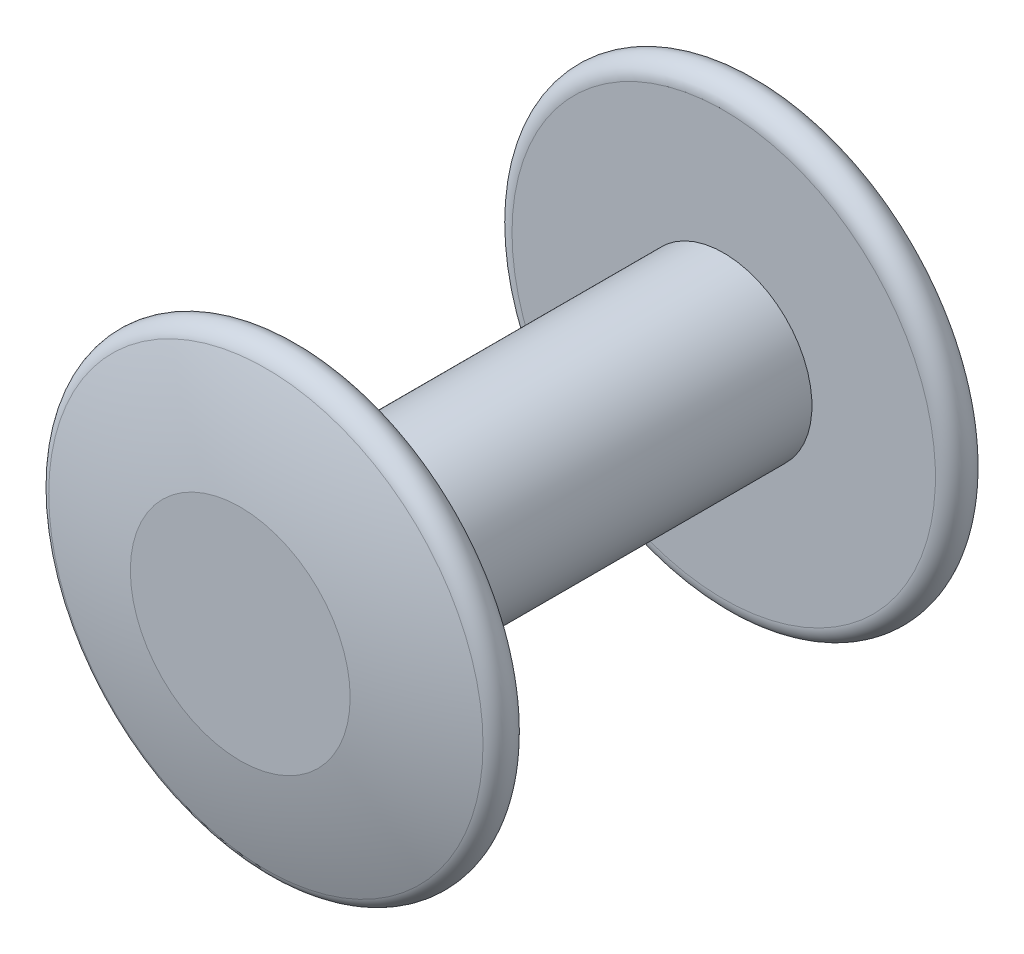
ISO-10303-21;
HEADER;
FILE_DESCRIPTION(('STEP AP214'),'2;1');
FILE_NAME('part.step','',(''),(''),'','','');
FILE_SCHEMA(('AUTOMOTIVE_DESIGN { 1 0 10303 214 1 1 1 1 }'));
ENDSEC;
DATA;
#1=APPLICATION_CONTEXT('core data for automotive mechanical design processes');
#2=APPLICATION_PROTOCOL_DEFINITION('international standard','automotive_design',2000,#1);
#3=PRODUCT_CONTEXT('',#1,'mechanical');
#4=PRODUCT('Part','Part','',(#3));
#5=PRODUCT_RELATED_PRODUCT_CATEGORY('part','',(#4));
#6=PRODUCT_DEFINITION_FORMATION('','',#4);
#7=PRODUCT_DEFINITION_CONTEXT('part definition',#1,'design');
#8=PRODUCT_DEFINITION('design','',#6,#7);
#9=PRODUCT_DEFINITION_SHAPE('','',#8);
#10=(LENGTH_UNIT() NAMED_UNIT(*) SI_UNIT(.MILLI.,.METRE.));
#11=(NAMED_UNIT(*) PLANE_ANGLE_UNIT() SI_UNIT($,.RADIAN.));
#12=(NAMED_UNIT(*) SI_UNIT($,.STERADIAN.) SOLID_ANGLE_UNIT());
#13=UNCERTAINTY_MEASURE_WITH_UNIT(LENGTH_MEASURE(1.E-05),#10,'distance_accuracy_value','');
#14=(GEOMETRIC_REPRESENTATION_CONTEXT(3) GLOBAL_UNCERTAINTY_ASSIGNED_CONTEXT((#13)) GLOBAL_UNIT_ASSIGNED_CONTEXT((#10,
#11,#12)) REPRESENTATION_CONTEXT('',''));
#15=CARTESIAN_POINT('',(0.,0.,0.));
#16=DIRECTION('',(0.,0.,1.));
#17=DIRECTION('',(1.,0.,0.));
#18=AXIS2_PLACEMENT_3D('',#15,#16,#17);
#19=CARTESIAN_POINT('',(0.,0.,6.5));
#20=DIRECTION('',(0.,0.,-1.));
#21=DIRECTION('',(-1.,0.,0.));
#22=AXIS2_PLACEMENT_3D('',#19,#20,#21);
#23=TOROIDAL_SURFACE('',#22,6.,0.5);
#24=CARTESIAN_POINT('',(0.,0.,6.));
#25=DIRECTION('',(0.,0.,-1.));
#26=DIRECTION('',(-1.,0.,0.));
#27=AXIS2_PLACEMENT_3D('',#24,#25,#26);
#28=CIRCLE('',#27,6.);
#29=CARTESIAN_POINT('',(-6.,0.,6.));
#30=VERTEX_POINT('',#29);
#31=EDGE_CURVE('E40',#30,#30,#28,.T.);
#32=ORIENTED_EDGE('',*,*,#31,.F.);
#33=EDGE_LOOP('',(#32));
#34=FACE_BOUND('',#33,.T.);
#35=CARTESIAN_POINT('',(0.,0.,6.97574295680204));
#36=DIRECTION('',(0.,0.,-1.));
#37=DIRECTION('',(-1.,0.,0.));
#38=AXIS2_PLACEMENT_3D('',#35,#36,#37);
#39=CIRCLE('',#38,6.15384615384616);
#40=CARTESIAN_POINT('',(-6.15384615384616,0.,6.97574295680204));
#41=VERTEX_POINT('',#40);
#42=EDGE_CURVE('E8',#41,#41,#39,.T.);
#43=ORIENTED_EDGE('',*,*,#42,.T.);
#44=EDGE_LOOP('',(#43));
#45=FACE_BOUND('',#44,.T.);
#46=ADVANCED_FACE('F12',(#34,#45),#23,.T.);
#47=CARTESIAN_POINT('',(0.,0.,-12.0539753152795));
#48=DIRECTION('',(0.,0.,-1.));
#49=DIRECTION('',(0.,1.,0.));
#50=AXIS2_PLACEMENT_3D('',#47,#48,#49);
#51=SPHERICAL_SURFACE('',#50,20.);
#52=ORIENTED_EDGE('',*,*,#42,.F.);
#53=EDGE_LOOP('',(#52));
#54=FACE_BOUND('',#53,.T.);
#55=CARTESIAN_POINT('',(0.,0.,7.70196512603628));
#56=DIRECTION('',(0.,0.,-1.));
#57=DIRECTION('',(-1.,0.,0.));
#58=AXIS2_PLACEMENT_3D('',#55,#56,#57);
#59=CIRCLE('',#58,3.11493455455888);
#60=CARTESIAN_POINT('',(-3.11493455455888,0.,7.70196512603628));
#61=VERTEX_POINT('',#60);
#62=EDGE_CURVE('E18',#61,#61,#59,.T.);
#63=ORIENTED_EDGE('',*,*,#62,.T.);
#64=EDGE_LOOP('',(#63));
#65=FACE_BOUND('',#64,.T.);
#66=ADVANCED_FACE('F47',(#54,#65),#51,.T.);
#67=CARTESIAN_POINT('',(0.,0.,7.70196512603628));
#68=DIRECTION('',(0.,0.,1.));
#69=DIRECTION('',(1.,0.,0.));
#70=AXIS2_PLACEMENT_3D('',#67,#68,#69);
#71=PLANE('',#70);
#72=ORIENTED_EDGE('',*,*,#62,.F.);
#73=EDGE_LOOP('',(#72));
#74=FACE_BOUND('',#73,.T.);
#75=ADVANCED_FACE('F53',(#74),#71,.T.);
#76=CARTESIAN_POINT('',(0.,0.,-7.70196512603628));
#77=DIRECTION('',(0.,0.,-1.));
#78=DIRECTION('',(-1.,0.,0.));
#79=AXIS2_PLACEMENT_3D('',#76,#77,#78);
#80=PLANE('',#79);
#81=CARTESIAN_POINT('',(0.,0.,-7.70196512603628));
#82=DIRECTION('',(0.,0.,-1.));
#83=DIRECTION('',(-1.,0.,0.));
#84=AXIS2_PLACEMENT_3D('',#81,#82,#83);
#85=CIRCLE('',#84,3.11493455455888);
#86=CARTESIAN_POINT('',(-3.11493455455888,0.,-7.70196512603628));
#87=VERTEX_POINT('',#86);
#88=EDGE_CURVE('E22',#87,#87,#85,.T.);
#89=ORIENTED_EDGE('',*,*,#88,.T.);
#90=EDGE_LOOP('',(#89));
#91=FACE_BOUND('',#90,.T.);
#92=ADVANCED_FACE('F59',(#91),#80,.T.);
#93=CARTESIAN_POINT('',(0.,0.,12.0539753152795));
#94=DIRECTION('',(0.,0.,-1.));
#95=DIRECTION('',(0.,1.,0.));
#96=AXIS2_PLACEMENT_3D('',#93,#94,#95);
#97=SPHERICAL_SURFACE('',#96,20.);
#98=CARTESIAN_POINT('',(0.,0.,-6.97574295680204));
#99=DIRECTION('',(0.,0.,-1.));
#100=DIRECTION('',(-1.,0.,0.));
#101=AXIS2_PLACEMENT_3D('',#98,#99,#100);
#102=CIRCLE('',#101,6.15384615384616);
#103=CARTESIAN_POINT('',(-6.15384615384616,0.,-6.97574295680204));
#104=VERTEX_POINT('',#103);
#105=EDGE_CURVE('E26',#104,#104,#102,.T.);
#106=ORIENTED_EDGE('',*,*,#105,.T.);
#107=EDGE_LOOP('',(#106));
#108=FACE_BOUND('',#107,.T.);
#109=ORIENTED_EDGE('',*,*,#88,.F.);
#110=EDGE_LOOP('',(#109));
#111=FACE_BOUND('',#110,.T.);
#112=ADVANCED_FACE('F65',(#108,#111),#97,.T.);
#113=CARTESIAN_POINT('',(0.,0.,-6.5));
#114=DIRECTION('',(0.,0.,-1.));
#115=DIRECTION('',(-1.,0.,0.));
#116=AXIS2_PLACEMENT_3D('',#113,#114,#115);
#117=TOROIDAL_SURFACE('',#116,6.,0.5);
#118=CARTESIAN_POINT('',(0.,0.,-6.));
#119=DIRECTION('',(0.,0.,-1.));
#120=DIRECTION('',(-1.,0.,0.));
#121=AXIS2_PLACEMENT_3D('',#118,#119,#120);
#122=CIRCLE('',#121,6.);
#123=CARTESIAN_POINT('',(-6.,0.,-6.));
#124=VERTEX_POINT('',#123);
#125=EDGE_CURVE('E31',#124,#124,#122,.T.);
#126=ORIENTED_EDGE('',*,*,#125,.T.);
#127=EDGE_LOOP('',(#126));
#128=FACE_BOUND('',#127,.T.);
#129=ORIENTED_EDGE('',*,*,#105,.F.);
#130=EDGE_LOOP('',(#129));
#131=FACE_BOUND('',#130,.T.);
#132=ADVANCED_FACE('F69',(#128,#131),#117,.T.);
#133=CARTESIAN_POINT('',(0.,0.,-6.));
#134=DIRECTION('',(0.,0.,1.));
#135=DIRECTION('',(1.,0.,0.));
#136=AXIS2_PLACEMENT_3D('',#133,#134,#135);
#137=PLANE('',#136);
#138=CARTESIAN_POINT('',(0.,0.,-6.));
#139=DIRECTION('',(0.,0.,-1.));
#140=DIRECTION('',(-1.,0.,0.));
#141=AXIS2_PLACEMENT_3D('',#138,#139,#140);
#142=CIRCLE('',#141,2.5);
#143=CARTESIAN_POINT('',(-2.5,0.,-6.));
#144=VERTEX_POINT('',#143);
#145=EDGE_CURVE('E34',#144,#144,#142,.T.);
#146=ORIENTED_EDGE('',*,*,#145,.T.);
#147=EDGE_LOOP('',(#146));
#148=FACE_BOUND('',#147,.T.);
#149=ORIENTED_EDGE('',*,*,#125,.F.);
#150=EDGE_LOOP('',(#149));
#151=FACE_BOUND('',#150,.T.);
#152=ADVANCED_FACE('F73',(#148,#151),#137,.T.);
#153=CARTESIAN_POINT('',(0.,0.,-7.94602468472053));
#154=DIRECTION('',(0.,0.,-1.));
#155=DIRECTION('',(-1.,0.,0.));
#156=AXIS2_PLACEMENT_3D('',#153,#154,#155);
#157=CYLINDRICAL_SURFACE('',#156,2.5);
#158=ORIENTED_EDGE('',*,*,#145,.F.);
#159=EDGE_LOOP('',(#158));
#160=FACE_BOUND('',#159,.T.);
#161=CARTESIAN_POINT('',(0.,0.,6.));
#162=DIRECTION('',(0.,0.,-1.));
#163=DIRECTION('',(-1.,0.,0.));
#164=AXIS2_PLACEMENT_3D('',#161,#162,#163);
#165=CIRCLE('',#164,2.5);
#166=CARTESIAN_POINT('',(-2.5,0.,6.));
#167=VERTEX_POINT('',#166);
#168=EDGE_CURVE('E37',#167,#167,#165,.T.);
#169=ORIENTED_EDGE('',*,*,#168,.T.);
#170=EDGE_LOOP('',(#169));
#171=FACE_BOUND('',#170,.T.);
#172=ADVANCED_FACE('F77',(#160,#171),#157,.T.);
#173=CARTESIAN_POINT('',(0.,0.,6.));
#174=DIRECTION('',(0.,0.,1.));
#175=DIRECTION('',(1.,0.,0.));
#176=AXIS2_PLACEMENT_3D('',#173,#174,#175);
#177=PLANE('',#176);
#178=ORIENTED_EDGE('',*,*,#168,.F.);
#179=EDGE_LOOP('',(#178));
#180=FACE_BOUND('',#179,.T.);
#181=ORIENTED_EDGE('',*,*,#31,.T.);
#182=EDGE_LOOP('',(#181));
#183=FACE_BOUND('',#182,.T.);
#184=ADVANCED_FACE('F44',(#180,#183),#177,.F.);
#185=CLOSED_SHELL('',(#46,#66,#75,#92,#112,#132,#152,#172,#184));
#186=MANIFOLD_SOLID_BREP('B1',#185);
#187=ADVANCED_BREP_SHAPE_REPRESENTATION('',(#18,#186),#14);
#188=SHAPE_DEFINITION_REPRESENTATION(#9,#187);
ENDSEC;
END-ISO-10303-21;
